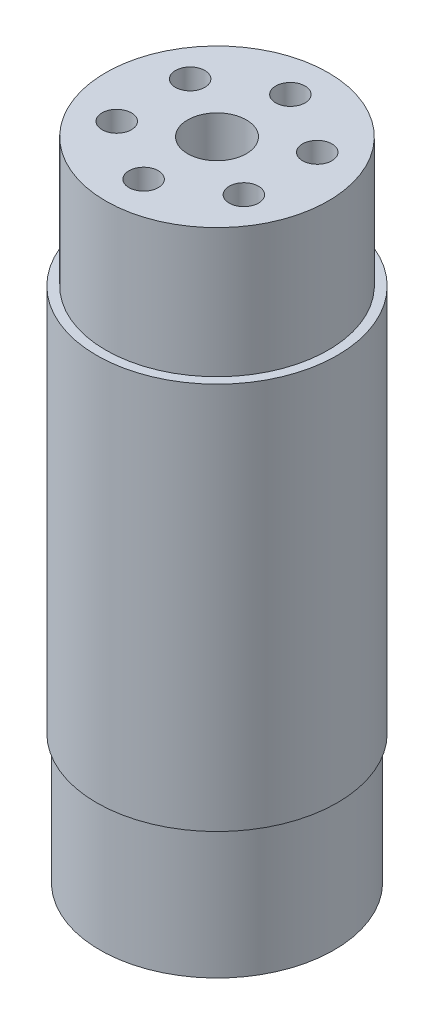
ISO-10303-21;
HEADER;
FILE_DESCRIPTION(('STEP AP214'),'2;1');
FILE_NAME('part.step','',(''),(''),'','','');
FILE_SCHEMA(('AUTOMOTIVE_DESIGN { 1 0 10303 214 1 1 1 1 }'));
ENDSEC;
DATA;
#1=APPLICATION_CONTEXT('core data for automotive mechanical design processes');
#2=APPLICATION_PROTOCOL_DEFINITION('international standard','automotive_design',2000,#1);
#3=PRODUCT_CONTEXT('',#1,'mechanical');
#4=PRODUCT('Part','Part','',(#3));
#5=PRODUCT_RELATED_PRODUCT_CATEGORY('part','',(#4));
#6=PRODUCT_DEFINITION_FORMATION('','',#4);
#7=PRODUCT_DEFINITION_CONTEXT('part definition',#1,'design');
#8=PRODUCT_DEFINITION('design','',#6,#7);
#9=PRODUCT_DEFINITION_SHAPE('','',#8);
#10=(LENGTH_UNIT() NAMED_UNIT(*) SI_UNIT(.MILLI.,.METRE.));
#11=(NAMED_UNIT(*) PLANE_ANGLE_UNIT() SI_UNIT($,.RADIAN.));
#12=(NAMED_UNIT(*) SI_UNIT($,.STERADIAN.) SOLID_ANGLE_UNIT());
#13=UNCERTAINTY_MEASURE_WITH_UNIT(LENGTH_MEASURE(1.E-05),#10,'distance_accuracy_value','');
#14=(GEOMETRIC_REPRESENTATION_CONTEXT(3) GLOBAL_UNCERTAINTY_ASSIGNED_CONTEXT((#13)) GLOBAL_UNIT_ASSIGNED_CONTEXT((#10,
#11,#12)) REPRESENTATION_CONTEXT('',''));
#15=CARTESIAN_POINT('',(0.,0.,0.));
#16=DIRECTION('',(0.,0.,1.));
#17=DIRECTION('',(1.,0.,0.));
#18=AXIS2_PLACEMENT_3D('',#15,#16,#17);
#19=CARTESIAN_POINT('',(0.,110.,0.));
#20=DIRECTION('',(0.,-1.,0.));
#21=DIRECTION('',(0.,0.,-1.));
#22=AXIS2_PLACEMENT_3D('',#19,#20,#21);
#23=CYLINDRICAL_SURFACE('',#22,20.5);
#24=CARTESIAN_POINT('',(0.,88.,0.));
#25=DIRECTION('',(0.,1.,0.));
#26=DIRECTION('',(0.,0.,1.));
#27=AXIS2_PLACEMENT_3D('',#24,#25,#26);
#28=CIRCLE('',#27,20.5);
#29=CARTESIAN_POINT('',(0.,88.,20.5));
#30=VERTEX_POINT('',#29);
#31=EDGE_CURVE('E11',#30,#30,#28,.T.);
#32=ORIENTED_EDGE('',*,*,#31,.F.);
#33=EDGE_LOOP('',(#32));
#34=FACE_BOUND('',#33,.T.);
#35=CARTESIAN_POINT('',(0.,22.,0.));
#36=DIRECTION('',(0.,-1.,0.));
#37=DIRECTION('',(0.,0.,-1.));
#38=AXIS2_PLACEMENT_3D('',#35,#36,#37);
#39=CIRCLE('',#38,20.5);
#40=CARTESIAN_POINT('',(0.,22.,-20.5));
#41=VERTEX_POINT('',#40);
#42=EDGE_CURVE('E42',#41,#41,#39,.T.);
#43=ORIENTED_EDGE('',*,*,#42,.F.);
#44=EDGE_LOOP('',(#43));
#45=FACE_BOUND('',#44,.T.);
#46=ADVANCED_FACE('F39',(#34,#45),#23,.T.);
#47=CARTESIAN_POINT('',(0.,88.,0.));
#48=DIRECTION('',(0.,1.,0.));
#49=DIRECTION('',(0.,0.,1.));
#50=AXIS2_PLACEMENT_3D('',#47,#48,#49);
#51=PLANE('',#50);
#52=CARTESIAN_POINT('',(0.,88.,0.));
#53=DIRECTION('',(0.,1.,0.));
#54=DIRECTION('',(0.,0.,1.));
#55=AXIS2_PLACEMENT_3D('',#52,#53,#54);
#56=CIRCLE('',#55,18.95);
#57=CARTESIAN_POINT('',(0.,88.,18.95));
#58=VERTEX_POINT('',#57);
#59=EDGE_CURVE('E47',#58,#58,#56,.T.);
#60=ORIENTED_EDGE('',*,*,#59,.F.);
#61=EDGE_LOOP('',(#60));
#62=FACE_BOUND('',#61,.T.);
#63=ORIENTED_EDGE('',*,*,#31,.T.);
#64=EDGE_LOOP('',(#63));
#65=FACE_BOUND('',#64,.T.);
#66=ADVANCED_FACE('F204',(#62,#65),#51,.T.);
#67=CARTESIAN_POINT('',(0.,88.,0.));
#68=DIRECTION('',(0.,1.,0.));
#69=DIRECTION('',(0.,0.,1.));
#70=AXIS2_PLACEMENT_3D('',#67,#68,#69);
#71=CYLINDRICAL_SURFACE('',#70,18.95);
#72=ORIENTED_EDGE('',*,*,#59,.T.);
#73=EDGE_LOOP('',(#72));
#74=FACE_BOUND('',#73,.T.);
#75=CARTESIAN_POINT('',(0.,110.,0.));
#76=DIRECTION('',(0.,1.,0.));
#77=DIRECTION('',(0.,0.,1.));
#78=AXIS2_PLACEMENT_3D('',#75,#76,#77);
#79=CIRCLE('',#78,18.95);
#80=CARTESIAN_POINT('',(0.,110.,18.95));
#81=VERTEX_POINT('',#80);
#82=EDGE_CURVE('E52',#81,#81,#79,.T.);
#83=ORIENTED_EDGE('',*,*,#82,.F.);
#84=EDGE_LOOP('',(#83));
#85=FACE_BOUND('',#84,.T.);
#86=ADVANCED_FACE('F209',(#74,#85),#71,.T.);
#87=CARTESIAN_POINT('',(0.,110.,0.));
#88=DIRECTION('',(0.,1.,0.));
#89=DIRECTION('',(0.,0.,1.));
#90=AXIS2_PLACEMENT_3D('',#87,#88,#89);
#91=PLANE('',#90);
#92=CARTESIAN_POINT('',(0.,110.,12.5));
#93=DIRECTION('',(0.,1.,0.));
#94=DIRECTION('',(0.,0.,1.));
#95=AXIS2_PLACEMENT_3D('',#92,#93,#94);
#96=CIRCLE('',#95,2.5);
#97=CARTESIAN_POINT('',(0.,110.,15.));
#98=VERTEX_POINT('',#97);
#99=EDGE_CURVE('E108',#98,#98,#96,.T.);
#100=ORIENTED_EDGE('',*,*,#99,.F.);
#101=EDGE_LOOP('',(#100));
#102=FACE_BOUND('',#101,.T.);
#103=CARTESIAN_POINT('',(10.8253175473054,110.,6.25000000000013));
#104=DIRECTION('',(0.,1.,0.));
#105=DIRECTION('',(0.,0.,1.));
#106=AXIS2_PLACEMENT_3D('',#103,#104,#105);
#107=CIRCLE('',#106,2.5);
#108=CARTESIAN_POINT('',(10.8253175473054,110.,8.75000000000013));
#109=VERTEX_POINT('',#108);
#110=EDGE_CURVE('E109',#109,#109,#107,.T.);
#111=ORIENTED_EDGE('',*,*,#110,.F.);
#112=EDGE_LOOP('',(#111));
#113=FACE_BOUND('',#112,.T.);
#114=CARTESIAN_POINT('',(10.8253175473055,110.,-6.2499999999999));
#115=DIRECTION('',(0.,1.,0.));
#116=DIRECTION('',(0.,0.,1.));
#117=AXIS2_PLACEMENT_3D('',#114,#115,#116);
#118=CIRCLE('',#117,2.5);
#119=CARTESIAN_POINT('',(10.8253175473055,110.,-3.7499999999999));
#120=VERTEX_POINT('',#119);
#121=EDGE_CURVE('E75',#120,#120,#118,.T.);
#122=ORIENTED_EDGE('',*,*,#121,.F.);
#123=EDGE_LOOP('',(#122));
#124=FACE_BOUND('',#123,.T.);
#125=CARTESIAN_POINT('',(0.,110.,-12.5));
#126=DIRECTION('',(0.,1.,0.));
#127=DIRECTION('',(0.,0.,1.));
#128=AXIS2_PLACEMENT_3D('',#125,#126,#127);
#129=CIRCLE('',#128,2.5);
#130=CARTESIAN_POINT('',(0.,110.,-10.));
#131=VERTEX_POINT('',#130);
#132=EDGE_CURVE('E84',#131,#131,#129,.T.);
#133=ORIENTED_EDGE('',*,*,#132,.F.);
#134=EDGE_LOOP('',(#133));
#135=FACE_BOUND('',#134,.T.);
#136=CARTESIAN_POINT('',(-10.8253175473055,110.,-6.25000000000005));
#137=DIRECTION('',(0.,1.,0.));
#138=DIRECTION('',(0.,0.,1.));
#139=AXIS2_PLACEMENT_3D('',#136,#137,#138);
#140=CIRCLE('',#139,2.5);
#141=CARTESIAN_POINT('',(-10.8253175473055,110.,-3.75000000000005));
#142=VERTEX_POINT('',#141);
#143=EDGE_CURVE('E92',#142,#142,#140,.T.);
#144=ORIENTED_EDGE('',*,*,#143,.F.);
#145=EDGE_LOOP('',(#144));
#146=FACE_BOUND('',#145,.T.);
#147=CARTESIAN_POINT('',(-10.8253175473055,110.,6.24999999999998));
#148=DIRECTION('',(0.,1.,0.));
#149=DIRECTION('',(0.,0.,1.));
#150=AXIS2_PLACEMENT_3D('',#147,#148,#149);
#151=CIRCLE('',#150,2.5);
#152=CARTESIAN_POINT('',(-10.8253175473055,110.,8.74999999999998));
#153=VERTEX_POINT('',#152);
#154=EDGE_CURVE('E100',#153,#153,#151,.T.);
#155=ORIENTED_EDGE('',*,*,#154,.F.);
#156=EDGE_LOOP('',(#155));
#157=FACE_BOUND('',#156,.T.);
#158=CARTESIAN_POINT('',(0.,110.,0.));
#159=DIRECTION('',(0.,1.,0.));
#160=DIRECTION('',(0.,0.,1.));
#161=AXIS2_PLACEMENT_3D('',#158,#159,#160);
#162=CIRCLE('',#161,5.);
#163=CARTESIAN_POINT('',(0.,110.,5.));
#164=VERTEX_POINT('',#163);
#165=EDGE_CURVE('E67',#164,#164,#162,.T.);
#166=ORIENTED_EDGE('',*,*,#165,.F.);
#167=EDGE_LOOP('',(#166));
#168=FACE_BOUND('',#167,.T.);
#169=ORIENTED_EDGE('',*,*,#82,.T.);
#170=EDGE_LOOP('',(#169));
#171=FACE_BOUND('',#170,.T.);
#172=ADVANCED_FACE('F199',(#102,#113,#124,#135,#146,#157,#168,#171),#91,.T.);
#173=CARTESIAN_POINT('',(0.,22.,0.));
#174=DIRECTION('',(0.,-1.,0.));
#175=DIRECTION('',(0.,0.,-1.));
#176=AXIS2_PLACEMENT_3D('',#173,#174,#175);
#177=PLANE('',#176);
#178=CARTESIAN_POINT('',(0.,22.,0.));
#179=DIRECTION('',(0.,-1.,0.));
#180=DIRECTION('',(0.,0.,-1.));
#181=AXIS2_PLACEMENT_3D('',#178,#179,#180);
#182=CIRCLE('',#181,19.95);
#183=CARTESIAN_POINT('',(0.,22.,-19.95));
#184=VERTEX_POINT('',#183);
#185=EDGE_CURVE('E62',#184,#184,#182,.T.);
#186=ORIENTED_EDGE('',*,*,#185,.F.);
#187=EDGE_LOOP('',(#186));
#188=FACE_BOUND('',#187,.T.);
#189=ORIENTED_EDGE('',*,*,#42,.T.);
#190=EDGE_LOOP('',(#189));
#191=FACE_BOUND('',#190,.T.);
#192=ADVANCED_FACE('F193',(#188,#191),#177,.T.);
#193=CARTESIAN_POINT('',(0.,22.,0.));
#194=DIRECTION('',(0.,-1.,0.));
#195=DIRECTION('',(0.,0.,-1.));
#196=AXIS2_PLACEMENT_3D('',#193,#194,#195);
#197=CYLINDRICAL_SURFACE('',#196,19.95);
#198=ORIENTED_EDGE('',*,*,#185,.T.);
#199=EDGE_LOOP('',(#198));
#200=FACE_BOUND('',#199,.T.);
#201=CARTESIAN_POINT('',(0.,0.,0.));
#202=DIRECTION('',(0.,-1.,0.));
#203=DIRECTION('',(0.,0.,-1.));
#204=AXIS2_PLACEMENT_3D('',#201,#202,#203);
#205=CIRCLE('',#204,19.95);
#206=CARTESIAN_POINT('',(0.,0.,-19.95));
#207=VERTEX_POINT('',#206);
#208=EDGE_CURVE('E58',#207,#207,#205,.T.);
#209=ORIENTED_EDGE('',*,*,#208,.F.);
#210=EDGE_LOOP('',(#209));
#211=FACE_BOUND('',#210,.T.);
#212=ADVANCED_FACE('F184',(#200,#211),#197,.T.);
#213=CARTESIAN_POINT('',(0.,0.,0.));
#214=DIRECTION('',(0.,1.,0.));
#215=DIRECTION('',(0.,0.,1.));
#216=AXIS2_PLACEMENT_3D('',#213,#214,#215);
#217=PLANE('',#216);
#218=CARTESIAN_POINT('',(10.8253175473054,0.,6.25000000000013));
#219=DIRECTION('',(0.,-1.,0.));
#220=DIRECTION('',(0.,0.,-1.));
#221=AXIS2_PLACEMENT_3D('',#218,#219,#220);
#222=CIRCLE('',#221,2.5);
#223=CARTESIAN_POINT('',(10.8253175473054,0.,3.75000000000012));
#224=VERTEX_POINT('',#223);
#225=EDGE_CURVE('E131',#224,#224,#222,.T.);
#226=ORIENTED_EDGE('',*,*,#225,.F.);
#227=EDGE_LOOP('',(#226));
#228=FACE_BOUND('',#227,.T.);
#229=CARTESIAN_POINT('',(0.,0.,12.5));
#230=DIRECTION('',(0.,-1.,0.));
#231=DIRECTION('',(0.,0.,-1.));
#232=AXIS2_PLACEMENT_3D('',#229,#230,#231);
#233=CIRCLE('',#232,2.5);
#234=CARTESIAN_POINT('',(0.,0.,10.));
#235=VERTEX_POINT('',#234);
#236=EDGE_CURVE('E139',#235,#235,#233,.T.);
#237=ORIENTED_EDGE('',*,*,#236,.F.);
#238=EDGE_LOOP('',(#237));
#239=FACE_BOUND('',#238,.T.);
#240=CARTESIAN_POINT('',(-10.8253175473055,0.,6.24999999999998));
#241=DIRECTION('',(0.,-1.,0.));
#242=DIRECTION('',(0.,0.,-1.));
#243=AXIS2_PLACEMENT_3D('',#240,#241,#242);
#244=CIRCLE('',#243,2.5);
#245=CARTESIAN_POINT('',(-10.8253175473055,0.,3.74999999999997));
#246=VERTEX_POINT('',#245);
#247=EDGE_CURVE('E147',#246,#246,#244,.T.);
#248=ORIENTED_EDGE('',*,*,#247,.F.);
#249=EDGE_LOOP('',(#248));
#250=FACE_BOUND('',#249,.T.);
#251=CARTESIAN_POINT('',(-10.8253175473055,0.,-6.25000000000005));
#252=DIRECTION('',(0.,-1.,0.));
#253=DIRECTION('',(0.,0.,-1.));
#254=AXIS2_PLACEMENT_3D('',#251,#252,#253);
#255=CIRCLE('',#254,2.5);
#256=CARTESIAN_POINT('',(-10.8253175473055,0.,-8.75000000000005));
#257=VERTEX_POINT('',#256);
#258=EDGE_CURVE('E155',#257,#257,#255,.T.);
#259=ORIENTED_EDGE('',*,*,#258,.F.);
#260=EDGE_LOOP('',(#259));
#261=FACE_BOUND('',#260,.T.);
#262=CARTESIAN_POINT('',(0.,0.,-12.5));
#263=DIRECTION('',(0.,-1.,0.));
#264=DIRECTION('',(0.,0.,-1.));
#265=AXIS2_PLACEMENT_3D('',#262,#263,#264);
#266=CIRCLE('',#265,2.5);
#267=CARTESIAN_POINT('',(0.,0.,-15.));
#268=VERTEX_POINT('',#267);
#269=EDGE_CURVE('E163',#268,#268,#266,.T.);
#270=ORIENTED_EDGE('',*,*,#269,.F.);
#271=EDGE_LOOP('',(#270));
#272=FACE_BOUND('',#271,.T.);
#273=CARTESIAN_POINT('',(10.8253175473055,0.,-6.2499999999999));
#274=DIRECTION('',(0.,-1.,0.));
#275=DIRECTION('',(0.,0.,-1.));
#276=AXIS2_PLACEMENT_3D('',#273,#274,#275);
#277=CIRCLE('',#276,2.5);
#278=CARTESIAN_POINT('',(10.8253175473055,0.,-8.7499999999999));
#279=VERTEX_POINT('',#278);
#280=EDGE_CURVE('E123',#279,#279,#277,.T.);
#281=ORIENTED_EDGE('',*,*,#280,.F.);
#282=EDGE_LOOP('',(#281));
#283=FACE_BOUND('',#282,.T.);
#284=CARTESIAN_POINT('',(0.,0.,0.));
#285=DIRECTION('',(0.,1.,0.));
#286=DIRECTION('',(0.,0.,1.));
#287=AXIS2_PLACEMENT_3D('',#284,#285,#286);
#288=CIRCLE('',#287,5.);
#289=CARTESIAN_POINT('',(0.,0.,5.));
#290=VERTEX_POINT('',#289);
#291=EDGE_CURVE('E63',#290,#290,#288,.T.);
#292=ORIENTED_EDGE('',*,*,#291,.T.);
#293=EDGE_LOOP('',(#292));
#294=FACE_BOUND('',#293,.T.);
#295=ORIENTED_EDGE('',*,*,#208,.T.);
#296=EDGE_LOOP('',(#295));
#297=FACE_BOUND('',#296,.T.);
#298=ADVANCED_FACE('F180',(#228,#239,#250,#261,#272,#283,#294,#297),#217,.F.);
#299=CARTESIAN_POINT('',(0.,0.,0.));
#300=DIRECTION('',(0.,1.,0.));
#301=DIRECTION('',(0.,0.,1.));
#302=AXIS2_PLACEMENT_3D('',#299,#300,#301);
#303=CYLINDRICAL_SURFACE('',#302,5.);
#304=ORIENTED_EDGE('',*,*,#291,.F.);
#305=EDGE_LOOP('',(#304));
#306=FACE_BOUND('',#305,.T.);
#307=ORIENTED_EDGE('',*,*,#165,.T.);
#308=EDGE_LOOP('',(#307));
#309=FACE_BOUND('',#308,.T.);
#310=ADVANCED_FACE('F183',(#306,#309),#303,.F.);
#311=CARTESIAN_POINT('',(-10.8253175473055,60.,6.24999999999998));
#312=DIRECTION('',(0.,1.,0.));
#313=DIRECTION('',(0.,0.,1.));
#314=AXIS2_PLACEMENT_3D('',#311,#312,#313);
#315=CYLINDRICAL_SURFACE('',#314,2.5);
#316=CARTESIAN_POINT('',(-10.8253175473055,60.,6.24999999999998));
#317=DIRECTION('',(0.,1.,0.));
#318=DIRECTION('',(0.,0.,1.));
#319=AXIS2_PLACEMENT_3D('',#316,#317,#318);
#320=CIRCLE('',#319,2.5);
#321=CARTESIAN_POINT('',(-10.8253175473055,60.,8.74999999999998));
#322=VERTEX_POINT('',#321);
#323=EDGE_CURVE('E104',#322,#322,#320,.T.);
#324=ORIENTED_EDGE('',*,*,#323,.F.);
#325=EDGE_LOOP('',(#324));
#326=FACE_BOUND('',#325,.T.);
#327=ORIENTED_EDGE('',*,*,#154,.T.);
#328=EDGE_LOOP('',(#327));
#329=FACE_BOUND('',#328,.T.);
#330=ADVANCED_FACE('F246',(#326,#329),#315,.F.);
#331=CARTESIAN_POINT('',(-10.8253175473055,60.,6.24999999999998));
#332=DIRECTION('',(0.,1.,0.));
#333=DIRECTION('',(0.,0.,1.));
#334=AXIS2_PLACEMENT_3D('',#331,#332,#333);
#335=PLANE('',#334);
#336=ORIENTED_EDGE('',*,*,#323,.T.);
#337=EDGE_LOOP('',(#336));
#338=FACE_BOUND('',#337,.T.);
#339=ADVANCED_FACE('F251',(#338),#335,.T.);
#340=CARTESIAN_POINT('',(-10.8253175473055,60.,-6.25000000000005));
#341=DIRECTION('',(0.,1.,0.));
#342=DIRECTION('',(0.,0.,1.));
#343=AXIS2_PLACEMENT_3D('',#340,#341,#342);
#344=CYLINDRICAL_SURFACE('',#343,2.5);
#345=CARTESIAN_POINT('',(-10.8253175473055,60.,-6.25000000000005));
#346=DIRECTION('',(0.,1.,0.));
#347=DIRECTION('',(0.,0.,1.));
#348=AXIS2_PLACEMENT_3D('',#345,#346,#347);
#349=CIRCLE('',#348,2.5);
#350=CARTESIAN_POINT('',(-10.8253175473055,60.,-3.75000000000005));
#351=VERTEX_POINT('',#350);
#352=EDGE_CURVE('E96',#351,#351,#349,.T.);
#353=ORIENTED_EDGE('',*,*,#352,.F.);
#354=EDGE_LOOP('',(#353));
#355=FACE_BOUND('',#354,.T.);
#356=ORIENTED_EDGE('',*,*,#143,.T.);
#357=EDGE_LOOP('',(#356));
#358=FACE_BOUND('',#357,.T.);
#359=ADVANCED_FACE('F273',(#355,#358),#344,.F.);
#360=CARTESIAN_POINT('',(-10.8253175473055,60.,-6.25000000000005));
#361=DIRECTION('',(0.,1.,0.));
#362=DIRECTION('',(0.,0.,1.));
#363=AXIS2_PLACEMENT_3D('',#360,#361,#362);
#364=PLANE('',#363);
#365=ORIENTED_EDGE('',*,*,#352,.T.);
#366=EDGE_LOOP('',(#365));
#367=FACE_BOUND('',#366,.T.);
#368=ADVANCED_FACE('F268',(#367),#364,.T.);
#369=CARTESIAN_POINT('',(0.,60.,-12.5));
#370=DIRECTION('',(0.,1.,0.));
#371=DIRECTION('',(0.,0.,1.));
#372=AXIS2_PLACEMENT_3D('',#369,#370,#371);
#373=CYLINDRICAL_SURFACE('',#372,2.5);
#374=CARTESIAN_POINT('',(0.,60.,-12.5));
#375=DIRECTION('',(0.,1.,0.));
#376=DIRECTION('',(0.,0.,1.));
#377=AXIS2_PLACEMENT_3D('',#374,#375,#376);
#378=CIRCLE('',#377,2.5);
#379=CARTESIAN_POINT('',(0.,60.,-10.));
#380=VERTEX_POINT('',#379);
#381=EDGE_CURVE('E88',#380,#380,#378,.T.);
#382=ORIENTED_EDGE('',*,*,#381,.F.);
#383=EDGE_LOOP('',(#382));
#384=FACE_BOUND('',#383,.T.);
#385=ORIENTED_EDGE('',*,*,#132,.T.);
#386=EDGE_LOOP('',(#385));
#387=FACE_BOUND('',#386,.T.);
#388=ADVANCED_FACE('F265',(#384,#387),#373,.F.);
#389=CARTESIAN_POINT('',(0.,60.,-12.5));
#390=DIRECTION('',(0.,1.,0.));
#391=DIRECTION('',(0.,0.,1.));
#392=AXIS2_PLACEMENT_3D('',#389,#390,#391);
#393=PLANE('',#392);
#394=ORIENTED_EDGE('',*,*,#381,.T.);
#395=EDGE_LOOP('',(#394));
#396=FACE_BOUND('',#395,.T.);
#397=ADVANCED_FACE('F259',(#396),#393,.T.);
#398=CARTESIAN_POINT('',(10.8253175473055,60.,-6.2499999999999));
#399=DIRECTION('',(0.,1.,0.));
#400=DIRECTION('',(0.,0.,1.));
#401=AXIS2_PLACEMENT_3D('',#398,#399,#400);
#402=CYLINDRICAL_SURFACE('',#401,2.5);
#403=CARTESIAN_POINT('',(10.8253175473055,60.,-6.2499999999999));
#404=DIRECTION('',(0.,1.,0.));
#405=DIRECTION('',(0.,0.,1.));
#406=AXIS2_PLACEMENT_3D('',#403,#404,#405);
#407=CIRCLE('',#406,2.5);
#408=CARTESIAN_POINT('',(10.8253175473055,60.,-3.7499999999999));
#409=VERTEX_POINT('',#408);
#410=EDGE_CURVE('E79',#409,#409,#407,.T.);
#411=ORIENTED_EDGE('',*,*,#410,.F.);
#412=EDGE_LOOP('',(#411));
#413=FACE_BOUND('',#412,.T.);
#414=ORIENTED_EDGE('',*,*,#121,.T.);
#415=EDGE_LOOP('',(#414));
#416=FACE_BOUND('',#415,.T.);
#417=ADVANCED_FACE('F255',(#413,#416),#402,.F.);
#418=CARTESIAN_POINT('',(10.8253175473055,60.,-6.2499999999999));
#419=DIRECTION('',(0.,1.,0.));
#420=DIRECTION('',(0.,0.,1.));
#421=AXIS2_PLACEMENT_3D('',#418,#419,#420);
#422=PLANE('',#421);
#423=ORIENTED_EDGE('',*,*,#410,.T.);
#424=EDGE_LOOP('',(#423));
#425=FACE_BOUND('',#424,.T.);
#426=ADVANCED_FACE('F258',(#425),#422,.T.);
#427=CARTESIAN_POINT('',(10.8253175473054,60.,6.25000000000013));
#428=DIRECTION('',(0.,1.,0.));
#429=DIRECTION('',(0.,0.,1.));
#430=AXIS2_PLACEMENT_3D('',#427,#428,#429);
#431=CYLINDRICAL_SURFACE('',#430,2.5);
#432=CARTESIAN_POINT('',(10.8253175473054,60.,6.25000000000013));
#433=DIRECTION('',(0.,1.,0.));
#434=DIRECTION('',(0.,0.,1.));
#435=AXIS2_PLACEMENT_3D('',#432,#433,#434);
#436=CIRCLE('',#435,2.5);
#437=CARTESIAN_POINT('',(10.8253175473054,60.,8.75000000000013));
#438=VERTEX_POINT('',#437);
#439=EDGE_CURVE('E80',#438,#438,#436,.T.);
#440=ORIENTED_EDGE('',*,*,#439,.F.);
#441=EDGE_LOOP('',(#440));
#442=FACE_BOUND('',#441,.T.);
#443=ORIENTED_EDGE('',*,*,#110,.T.);
#444=EDGE_LOOP('',(#443));
#445=FACE_BOUND('',#444,.T.);
#446=ADVANCED_FACE('F263',(#442,#445),#431,.F.);
#447=CARTESIAN_POINT('',(10.8253175473054,60.,6.25000000000013));
#448=DIRECTION('',(0.,1.,0.));
#449=DIRECTION('',(0.,0.,1.));
#450=AXIS2_PLACEMENT_3D('',#447,#448,#449);
#451=PLANE('',#450);
#452=ORIENTED_EDGE('',*,*,#439,.T.);
#453=EDGE_LOOP('',(#452));
#454=FACE_BOUND('',#453,.T.);
#455=ADVANCED_FACE('F285',(#454),#451,.T.);
#456=CARTESIAN_POINT('',(0.,60.,12.5));
#457=DIRECTION('',(0.,1.,0.));
#458=DIRECTION('',(0.,0.,1.));
#459=AXIS2_PLACEMENT_3D('',#456,#457,#458);
#460=CYLINDRICAL_SURFACE('',#459,2.5);
#461=CARTESIAN_POINT('',(0.,60.,12.5));
#462=DIRECTION('',(0.,1.,0.));
#463=DIRECTION('',(0.,0.,1.));
#464=AXIS2_PLACEMENT_3D('',#461,#462,#463);
#465=CIRCLE('',#464,2.5);
#466=CARTESIAN_POINT('',(0.,60.,15.));
#467=VERTEX_POINT('',#466);
#468=EDGE_CURVE('E71',#467,#467,#465,.T.);
#469=ORIENTED_EDGE('',*,*,#468,.F.);
#470=EDGE_LOOP('',(#469));
#471=FACE_BOUND('',#470,.T.);
#472=ORIENTED_EDGE('',*,*,#99,.T.);
#473=EDGE_LOOP('',(#472));
#474=FACE_BOUND('',#473,.T.);
#475=ADVANCED_FACE('F289',(#471,#474),#460,.F.);
#476=CARTESIAN_POINT('',(0.,60.,12.5));
#477=DIRECTION('',(0.,1.,0.));
#478=DIRECTION('',(0.,0.,1.));
#479=AXIS2_PLACEMENT_3D('',#476,#477,#478);
#480=PLANE('',#479);
#481=ORIENTED_EDGE('',*,*,#468,.T.);
#482=EDGE_LOOP('',(#481));
#483=FACE_BOUND('',#482,.T.);
#484=ADVANCED_FACE('F293',(#483),#480,.T.);
#485=CARTESIAN_POINT('',(10.8253175473055,50.,-6.2499999999999));
#486=DIRECTION('',(0.,-1.,0.));
#487=DIRECTION('',(0.,0.,-1.));
#488=AXIS2_PLACEMENT_3D('',#485,#486,#487);
#489=CYLINDRICAL_SURFACE('',#488,2.5);
#490=CARTESIAN_POINT('',(10.8253175473055,50.,-6.2499999999999));
#491=DIRECTION('',(0.,-1.,0.));
#492=DIRECTION('',(0.,0.,-1.));
#493=AXIS2_PLACEMENT_3D('',#490,#491,#492);
#494=CIRCLE('',#493,2.5);
#495=CARTESIAN_POINT('',(10.8253175473055,50.,-8.7499999999999));
#496=VERTEX_POINT('',#495);
#497=EDGE_CURVE('E113',#496,#496,#494,.T.);
#498=ORIENTED_EDGE('',*,*,#497,.F.);
#499=EDGE_LOOP('',(#498));
#500=FACE_BOUND('',#499,.T.);
#501=ORIENTED_EDGE('',*,*,#280,.T.);
#502=EDGE_LOOP('',(#501));
#503=FACE_BOUND('',#502,.T.);
#504=ADVANCED_FACE('F297',(#500,#503),#489,.F.);
#505=CARTESIAN_POINT('',(10.8253175473055,50.,-6.2499999999999));
#506=DIRECTION('',(0.,-1.,0.));
#507=DIRECTION('',(0.,0.,-1.));
#508=AXIS2_PLACEMENT_3D('',#505,#506,#507);
#509=PLANE('',#508);
#510=ORIENTED_EDGE('',*,*,#497,.T.);
#511=EDGE_LOOP('',(#510));
#512=FACE_BOUND('',#511,.T.);
#513=ADVANCED_FACE('F176',(#512),#509,.T.);
#514=CARTESIAN_POINT('',(0.,50.,-12.5));
#515=DIRECTION('',(0.,-1.,0.));
#516=DIRECTION('',(0.,0.,-1.));
#517=AXIS2_PLACEMENT_3D('',#514,#515,#516);
#518=CYLINDRICAL_SURFACE('',#517,2.5);
#519=CARTESIAN_POINT('',(0.,50.,-12.5));
#520=DIRECTION('',(0.,-1.,0.));
#521=DIRECTION('',(0.,0.,-1.));
#522=AXIS2_PLACEMENT_3D('',#519,#520,#521);
#523=CIRCLE('',#522,2.5);
#524=CARTESIAN_POINT('',(0.,50.,-15.));
#525=VERTEX_POINT('',#524);
#526=EDGE_CURVE('E127',#525,#525,#523,.T.);
#527=ORIENTED_EDGE('',*,*,#526,.F.);
#528=EDGE_LOOP('',(#527));
#529=FACE_BOUND('',#528,.T.);
#530=ORIENTED_EDGE('',*,*,#269,.T.);
#531=EDGE_LOOP('',(#530));
#532=FACE_BOUND('',#531,.T.);
#533=ADVANCED_FACE('F173',(#529,#532),#518,.F.);
#534=CARTESIAN_POINT('',(0.,50.,-12.5));
#535=DIRECTION('',(0.,-1.,0.));
#536=DIRECTION('',(0.,0.,-1.));
#537=AXIS2_PLACEMENT_3D('',#534,#535,#536);
#538=PLANE('',#537);
#539=ORIENTED_EDGE('',*,*,#526,.T.);
#540=EDGE_LOOP('',(#539));
#541=FACE_BOUND('',#540,.T.);
#542=ADVANCED_FACE('F171',(#541),#538,.T.);
#543=CARTESIAN_POINT('',(-10.8253175473055,50.,-6.25000000000005));
#544=DIRECTION('',(0.,-1.,0.));
#545=DIRECTION('',(0.,0.,-1.));
#546=AXIS2_PLACEMENT_3D('',#543,#544,#545);
#547=CYLINDRICAL_SURFACE('',#546,2.5);
#548=CARTESIAN_POINT('',(-10.8253175473055,50.,-6.25000000000005));
#549=DIRECTION('',(0.,-1.,0.));
#550=DIRECTION('',(0.,0.,-1.));
#551=AXIS2_PLACEMENT_3D('',#548,#549,#550);
#552=CIRCLE('',#551,2.5);
#553=CARTESIAN_POINT('',(-10.8253175473055,50.,-8.75000000000005));
#554=VERTEX_POINT('',#553);
#555=EDGE_CURVE('E159',#554,#554,#552,.T.);
#556=ORIENTED_EDGE('',*,*,#555,.F.);
#557=EDGE_LOOP('',(#556));
#558=FACE_BOUND('',#557,.T.);
#559=ORIENTED_EDGE('',*,*,#258,.T.);
#560=EDGE_LOOP('',(#559));
#561=FACE_BOUND('',#560,.T.);
#562=ADVANCED_FACE('F330',(#558,#561),#547,.F.);
#563=CARTESIAN_POINT('',(-10.8253175473055,50.,-6.25000000000005));
#564=DIRECTION('',(0.,-1.,0.));
#565=DIRECTION('',(0.,0.,-1.));
#566=AXIS2_PLACEMENT_3D('',#563,#564,#565);
#567=PLANE('',#566);
#568=ORIENTED_EDGE('',*,*,#555,.T.);
#569=EDGE_LOOP('',(#568));
#570=FACE_BOUND('',#569,.T.);
#571=ADVANCED_FACE('F325',(#570),#567,.T.);
#572=CARTESIAN_POINT('',(-10.8253175473055,50.,6.24999999999998));
#573=DIRECTION('',(0.,-1.,0.));
#574=DIRECTION('',(0.,0.,-1.));
#575=AXIS2_PLACEMENT_3D('',#572,#573,#574);
#576=CYLINDRICAL_SURFACE('',#575,2.5);
#577=CARTESIAN_POINT('',(-10.8253175473055,50.,6.24999999999998));
#578=DIRECTION('',(0.,-1.,0.));
#579=DIRECTION('',(0.,0.,-1.));
#580=AXIS2_PLACEMENT_3D('',#577,#578,#579);
#581=CIRCLE('',#580,2.5);
#582=CARTESIAN_POINT('',(-10.8253175473055,50.,3.74999999999997));
#583=VERTEX_POINT('',#582);
#584=EDGE_CURVE('E151',#583,#583,#581,.T.);
#585=ORIENTED_EDGE('',*,*,#584,.F.);
#586=EDGE_LOOP('',(#585));
#587=FACE_BOUND('',#586,.T.);
#588=ORIENTED_EDGE('',*,*,#247,.T.);
#589=EDGE_LOOP('',(#588));
#590=FACE_BOUND('',#589,.T.);
#591=ADVANCED_FACE('F322',(#587,#590),#576,.F.);
#592=CARTESIAN_POINT('',(-10.8253175473055,50.,6.24999999999998));
#593=DIRECTION('',(0.,-1.,0.));
#594=DIRECTION('',(0.,0.,-1.));
#595=AXIS2_PLACEMENT_3D('',#592,#593,#594);
#596=PLANE('',#595);
#597=ORIENTED_EDGE('',*,*,#584,.T.);
#598=EDGE_LOOP('',(#597));
#599=FACE_BOUND('',#598,.T.);
#600=ADVANCED_FACE('F317',(#599),#596,.T.);
#601=CARTESIAN_POINT('',(0.,50.,12.5));
#602=DIRECTION('',(0.,-1.,0.));
#603=DIRECTION('',(0.,0.,-1.));
#604=AXIS2_PLACEMENT_3D('',#601,#602,#603);
#605=CYLINDRICAL_SURFACE('',#604,2.5);
#606=CARTESIAN_POINT('',(0.,50.,12.5));
#607=DIRECTION('',(0.,-1.,0.));
#608=DIRECTION('',(0.,0.,-1.));
#609=AXIS2_PLACEMENT_3D('',#606,#607,#608);
#610=CIRCLE('',#609,2.5);
#611=CARTESIAN_POINT('',(0.,50.,10.));
#612=VERTEX_POINT('',#611);
#613=EDGE_CURVE('E143',#612,#612,#610,.T.);
#614=ORIENTED_EDGE('',*,*,#613,.F.);
#615=EDGE_LOOP('',(#614));
#616=FACE_BOUND('',#615,.T.);
#617=ORIENTED_EDGE('',*,*,#236,.T.);
#618=EDGE_LOOP('',(#617));
#619=FACE_BOUND('',#618,.T.);
#620=ADVANCED_FACE('F314',(#616,#619),#605,.F.);
#621=CARTESIAN_POINT('',(0.,50.,12.5));
#622=DIRECTION('',(0.,-1.,0.));
#623=DIRECTION('',(0.,0.,-1.));
#624=AXIS2_PLACEMENT_3D('',#621,#622,#623);
#625=PLANE('',#624);
#626=ORIENTED_EDGE('',*,*,#613,.T.);
#627=EDGE_LOOP('',(#626));
#628=FACE_BOUND('',#627,.T.);
#629=ADVANCED_FACE('F309',(#628),#625,.T.);
#630=CARTESIAN_POINT('',(10.8253175473054,50.,6.25000000000013));
#631=DIRECTION('',(0.,-1.,0.));
#632=DIRECTION('',(0.,0.,-1.));
#633=AXIS2_PLACEMENT_3D('',#630,#631,#632);
#634=CYLINDRICAL_SURFACE('',#633,2.5);
#635=CARTESIAN_POINT('',(10.8253175473054,50.,6.25000000000013));
#636=DIRECTION('',(0.,-1.,0.));
#637=DIRECTION('',(0.,0.,-1.));
#638=AXIS2_PLACEMENT_3D('',#635,#636,#637);
#639=CIRCLE('',#638,2.5);
#640=CARTESIAN_POINT('',(10.8253175473054,50.,3.75000000000012));
#641=VERTEX_POINT('',#640);
#642=EDGE_CURVE('E135',#641,#641,#639,.T.);
#643=ORIENTED_EDGE('',*,*,#642,.F.);
#644=EDGE_LOOP('',(#643));
#645=FACE_BOUND('',#644,.T.);
#646=ORIENTED_EDGE('',*,*,#225,.T.);
#647=EDGE_LOOP('',(#646));
#648=FACE_BOUND('',#647,.T.);
#649=ADVANCED_FACE('F305',(#645,#648),#634,.F.);
#650=CARTESIAN_POINT('',(10.8253175473054,50.,6.25000000000013));
#651=DIRECTION('',(0.,-1.,0.));
#652=DIRECTION('',(0.,0.,-1.));
#653=AXIS2_PLACEMENT_3D('',#650,#651,#652);
#654=PLANE('',#653);
#655=ORIENTED_EDGE('',*,*,#642,.T.);
#656=EDGE_LOOP('',(#655));
#657=FACE_BOUND('',#656,.T.);
#658=ADVANCED_FACE('F308',(#657),#654,.T.);
#659=CLOSED_SHELL('',(#46,#66,#86,#172,#192,#212,#298,#310,#330,#339,#359,#368,#388,#397,#417,
#426,#446,#455,#475,#484,#504,#513,#533,#542,#562,#571,#591,#600,#620,#629,#649,#658));
#660=MANIFOLD_SOLID_BREP('B2',#659);
#661=ADVANCED_BREP_SHAPE_REPRESENTATION('',(#18,#660),#14);
#662=SHAPE_DEFINITION_REPRESENTATION(#9,#661);
ENDSEC;
END-ISO-10303-21;
